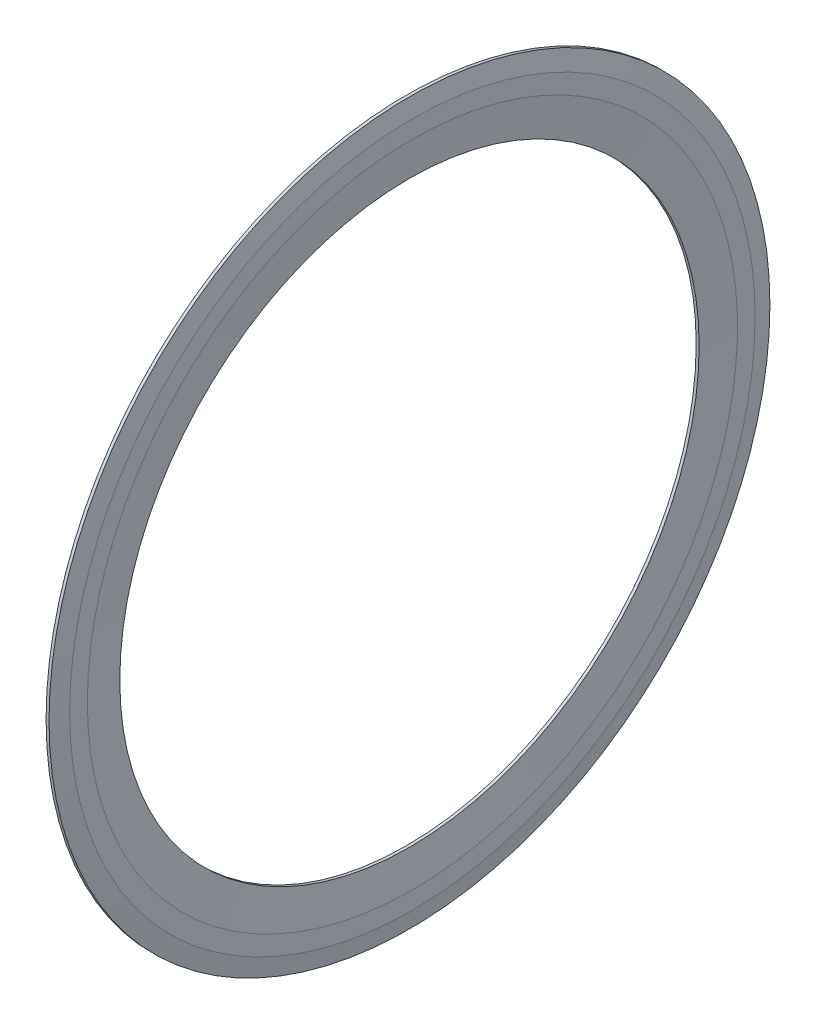
ISO-10303-21;
HEADER;
FILE_DESCRIPTION(('STEP AP214'),'2;1');
FILE_NAME('part.step','',(''),(''),'','','');
FILE_SCHEMA(('AUTOMOTIVE_DESIGN { 1 0 10303 214 1 1 1 1 }'));
ENDSEC;
DATA;
#1=APPLICATION_CONTEXT('core data for automotive mechanical design processes');
#2=APPLICATION_PROTOCOL_DEFINITION('international standard','automotive_design',2000,#1);
#3=PRODUCT_CONTEXT('',#1,'mechanical');
#4=PRODUCT('Part','Part','',(#3));
#5=PRODUCT_RELATED_PRODUCT_CATEGORY('part','',(#4));
#6=PRODUCT_DEFINITION_FORMATION('','',#4);
#7=PRODUCT_DEFINITION_CONTEXT('part definition',#1,'design');
#8=PRODUCT_DEFINITION('design','',#6,#7);
#9=PRODUCT_DEFINITION_SHAPE('','',#8);
#10=(LENGTH_UNIT() NAMED_UNIT(*) SI_UNIT(.MILLI.,.METRE.));
#11=(NAMED_UNIT(*) PLANE_ANGLE_UNIT() SI_UNIT($,.RADIAN.));
#12=(NAMED_UNIT(*) SI_UNIT($,.STERADIAN.) SOLID_ANGLE_UNIT());
#13=UNCERTAINTY_MEASURE_WITH_UNIT(LENGTH_MEASURE(1.E-05),#10,'distance_accuracy_value','');
#14=(GEOMETRIC_REPRESENTATION_CONTEXT(3) GLOBAL_UNCERTAINTY_ASSIGNED_CONTEXT((#13)) GLOBAL_UNIT_ASSIGNED_CONTEXT((#10,
#11,#12)) REPRESENTATION_CONTEXT('',''));
#15=CARTESIAN_POINT('',(0.,0.,0.));
#16=DIRECTION('',(0.,0.,1.));
#17=DIRECTION('',(1.,0.,0.));
#18=AXIS2_PLACEMENT_3D('',#15,#16,#17);
#19=CARTESIAN_POINT('',(50.,0.,0.));
#20=DIRECTION('',(-1.,0.,0.));
#21=DIRECTION('',(0.,0.,1.));
#22=AXIS2_PLACEMENT_3D('',#19,#20,#21);
#23=CYLINDRICAL_SURFACE('',#22,11.075);
#24=CARTESIAN_POINT('',(0.269999999999999,0.,0.));
#25=DIRECTION('',(-1.,0.,0.));
#26=DIRECTION('',(0.,0.,1.));
#27=AXIS2_PLACEMENT_3D('',#24,#25,#26);
#28=CIRCLE('',#27,11.075);
#29=CARTESIAN_POINT('',(0.269999999999999,0.,11.075));
#30=VERTEX_POINT('',#29);
#31=EDGE_CURVE('E10',#30,#30,#28,.T.);
#32=ORIENTED_EDGE('',*,*,#31,.F.);
#33=EDGE_LOOP('',(#32));
#34=FACE_BOUND('',#33,.T.);
#35=CARTESIAN_POINT('',(0.359999999999999,0.,0.));
#36=DIRECTION('',(-1.,0.,0.));
#37=DIRECTION('',(0.,0.,1.));
#38=AXIS2_PLACEMENT_3D('',#35,#36,#37);
#39=CIRCLE('',#38,11.075);
#40=CARTESIAN_POINT('',(0.359999999999999,0.,11.075));
#41=VERTEX_POINT('',#40);
#42=EDGE_CURVE('E61',#41,#41,#39,.T.);
#43=ORIENTED_EDGE('',*,*,#42,.T.);
#44=EDGE_LOOP('',(#43));
#45=FACE_BOUND('',#44,.T.);
#46=ADVANCED_FACE('F33',(#34,#45),#23,.T.);
#47=CARTESIAN_POINT('',(0.269999999999999,0.,0.));
#48=DIRECTION('',(-1.,0.,0.));
#49=DIRECTION('',(0.,0.,1.));
#50=AXIS2_PLACEMENT_3D('',#47,#48,#49);
#51=CONICAL_SURFACE('',#50,11.075,1.48822587110017);
#52=CARTESIAN_POINT('',(0.315000000000003,0.,0.));
#53=DIRECTION('',(-1.,0.,0.));
#54=DIRECTION('',(0.,0.,1.));
#55=AXIS2_PLACEMENT_3D('',#52,#53,#54);
#56=CIRCLE('',#55,10.53125);
#57=CARTESIAN_POINT('',(0.315000000000003,0.,10.53125));
#58=VERTEX_POINT('',#57);
#59=EDGE_CURVE('E39',#58,#58,#56,.T.);
#60=ORIENTED_EDGE('',*,*,#59,.F.);
#61=EDGE_LOOP('',(#60));
#62=FACE_BOUND('',#61,.T.);
#63=ORIENTED_EDGE('',*,*,#31,.T.);
#64=EDGE_LOOP('',(#63));
#65=FACE_BOUND('',#64,.T.);
#66=ADVANCED_FACE('F98',(#62,#65),#51,.F.);
#67=CARTESIAN_POINT('',(0.315000000000003,0.,0.));
#68=DIRECTION('',(1.,0.,0.));
#69=DIRECTION('',(0.,0.,-1.));
#70=AXIS2_PLACEMENT_3D('',#67,#68,#69);
#71=CONICAL_SURFACE('',#70,10.53125,1.48822587110017);
#72=CARTESIAN_POINT('',(0.269999999999999,0.,0.));
#73=DIRECTION('',(-1.,0.,0.));
#74=DIRECTION('',(0.,0.,1.));
#75=AXIS2_PLACEMENT_3D('',#72,#73,#74);
#76=CIRCLE('',#75,9.9875);
#77=CARTESIAN_POINT('',(0.269999999999999,0.,9.9875));
#78=VERTEX_POINT('',#77);
#79=EDGE_CURVE('E43',#78,#78,#76,.T.);
#80=ORIENTED_EDGE('',*,*,#79,.F.);
#81=EDGE_LOOP('',(#80));
#82=FACE_BOUND('',#81,.T.);
#83=ORIENTED_EDGE('',*,*,#59,.T.);
#84=EDGE_LOOP('',(#83));
#85=FACE_BOUND('',#84,.T.);
#86=ADVANCED_FACE('F93',(#82,#85),#71,.T.);
#87=CARTESIAN_POINT('',(0.27,9.9875,0.));
#88=DIRECTION('',(1.,0.,0.));
#89=DIRECTION('',(0.,0.,-1.));
#90=AXIS2_PLACEMENT_3D('',#87,#88,#89);
#91=PLANE('',#90);
#92=CARTESIAN_POINT('',(0.269999999999999,0.,0.));
#93=DIRECTION('',(-1.,0.,0.));
#94=DIRECTION('',(0.,0.,1.));
#95=AXIS2_PLACEMENT_3D('',#92,#93,#94);
#96=CIRCLE('',#95,8.9);
#97=CARTESIAN_POINT('',(0.269999999999999,0.,8.9));
#98=VERTEX_POINT('',#97);
#99=EDGE_CURVE('E47',#98,#98,#96,.T.);
#100=ORIENTED_EDGE('',*,*,#99,.F.);
#101=EDGE_LOOP('',(#100));
#102=FACE_BOUND('',#101,.T.);
#103=ORIENTED_EDGE('',*,*,#79,.T.);
#104=EDGE_LOOP('',(#103));
#105=FACE_BOUND('',#104,.T.);
#106=ADVANCED_FACE('F87',(#102,#105),#91,.F.);
#107=CARTESIAN_POINT('',(50.,0.,0.));
#108=DIRECTION('',(-1.,0.,0.));
#109=DIRECTION('',(0.,0.,1.));
#110=AXIS2_PLACEMENT_3D('',#107,#108,#109);
#111=CYLINDRICAL_SURFACE('',#110,8.9);
#112=CARTESIAN_POINT('',(0.359999999999999,0.,0.));
#113=DIRECTION('',(-1.,0.,0.));
#114=DIRECTION('',(0.,0.,1.));
#115=AXIS2_PLACEMENT_3D('',#112,#113,#114);
#116=CIRCLE('',#115,8.9);
#117=CARTESIAN_POINT('',(0.359999999999999,0.,8.9));
#118=VERTEX_POINT('',#117);
#119=EDGE_CURVE('E52',#118,#118,#116,.T.);
#120=ORIENTED_EDGE('',*,*,#119,.F.);
#121=EDGE_LOOP('',(#120));
#122=FACE_BOUND('',#121,.T.);
#123=ORIENTED_EDGE('',*,*,#99,.T.);
#124=EDGE_LOOP('',(#123));
#125=FACE_BOUND('',#124,.T.);
#126=ADVANCED_FACE('F81',(#122,#125),#111,.F.);
#127=CARTESIAN_POINT('',(0.359999999999999,0.,0.));
#128=DIRECTION('',(1.,0.,0.));
#129=DIRECTION('',(0.,0.,-1.));
#130=AXIS2_PLACEMENT_3D('',#127,#128,#129);
#131=CONICAL_SURFACE('',#130,8.9,1.48822587110018);
#132=CARTESIAN_POINT('',(0.449999999999999,0.,0.));
#133=DIRECTION('',(-1.,0.,0.));
#134=DIRECTION('',(0.,0.,1.));
#135=AXIS2_PLACEMENT_3D('',#132,#133,#134);
#136=CIRCLE('',#135,9.9875);
#137=CARTESIAN_POINT('',(0.449999999999999,0.,9.9875));
#138=VERTEX_POINT('',#137);
#139=EDGE_CURVE('E55',#138,#138,#136,.T.);
#140=ORIENTED_EDGE('',*,*,#139,.F.);
#141=EDGE_LOOP('',(#140));
#142=FACE_BOUND('',#141,.T.);
#143=ORIENTED_EDGE('',*,*,#119,.T.);
#144=EDGE_LOOP('',(#143));
#145=FACE_BOUND('',#144,.T.);
#146=ADVANCED_FACE('F75',(#142,#145),#131,.F.);
#147=CARTESIAN_POINT('',(0.45,9.9875,0.));
#148=DIRECTION('',(-1.,0.,0.));
#149=DIRECTION('',(0.,0.,1.));
#150=AXIS2_PLACEMENT_3D('',#147,#148,#149);
#151=PLANE('',#150);
#152=CARTESIAN_POINT('',(0.449999999999999,0.,0.));
#153=DIRECTION('',(-1.,0.,0.));
#154=DIRECTION('',(0.,0.,1.));
#155=AXIS2_PLACEMENT_3D('',#152,#153,#154);
#156=CIRCLE('',#155,10.53125);
#157=CARTESIAN_POINT('',(0.449999999999999,0.,10.53125));
#158=VERTEX_POINT('',#157);
#159=EDGE_CURVE('E58',#158,#158,#156,.T.);
#160=ORIENTED_EDGE('',*,*,#159,.F.);
#161=EDGE_LOOP('',(#160));
#162=FACE_BOUND('',#161,.T.);
#163=ORIENTED_EDGE('',*,*,#139,.T.);
#164=EDGE_LOOP('',(#163));
#165=FACE_BOUND('',#164,.T.);
#166=ADVANCED_FACE('F69',(#162,#165),#151,.F.);
#167=CARTESIAN_POINT('',(0.449999999999999,0.,0.));
#168=DIRECTION('',(-1.,0.,0.));
#169=DIRECTION('',(0.,0.,1.));
#170=AXIS2_PLACEMENT_3D('',#167,#168,#169);
#171=CONICAL_SURFACE('',#170,10.53125,1.40676621714642);
#172=ORIENTED_EDGE('',*,*,#42,.F.);
#173=EDGE_LOOP('',(#172));
#174=FACE_BOUND('',#173,.T.);
#175=ORIENTED_EDGE('',*,*,#159,.T.);
#176=EDGE_LOOP('',(#175));
#177=FACE_BOUND('',#176,.T.);
#178=ADVANCED_FACE('F66',(#174,#177),#171,.T.);
#179=CLOSED_SHELL('',(#46,#66,#86,#106,#126,#146,#166,#178));
#180=MANIFOLD_SOLID_BREP('B2',#179);
#181=ADVANCED_BREP_SHAPE_REPRESENTATION('',(#18,#180),#14);
#182=SHAPE_DEFINITION_REPRESENTATION(#9,#181);
ENDSEC;
END-ISO-10303-21;
